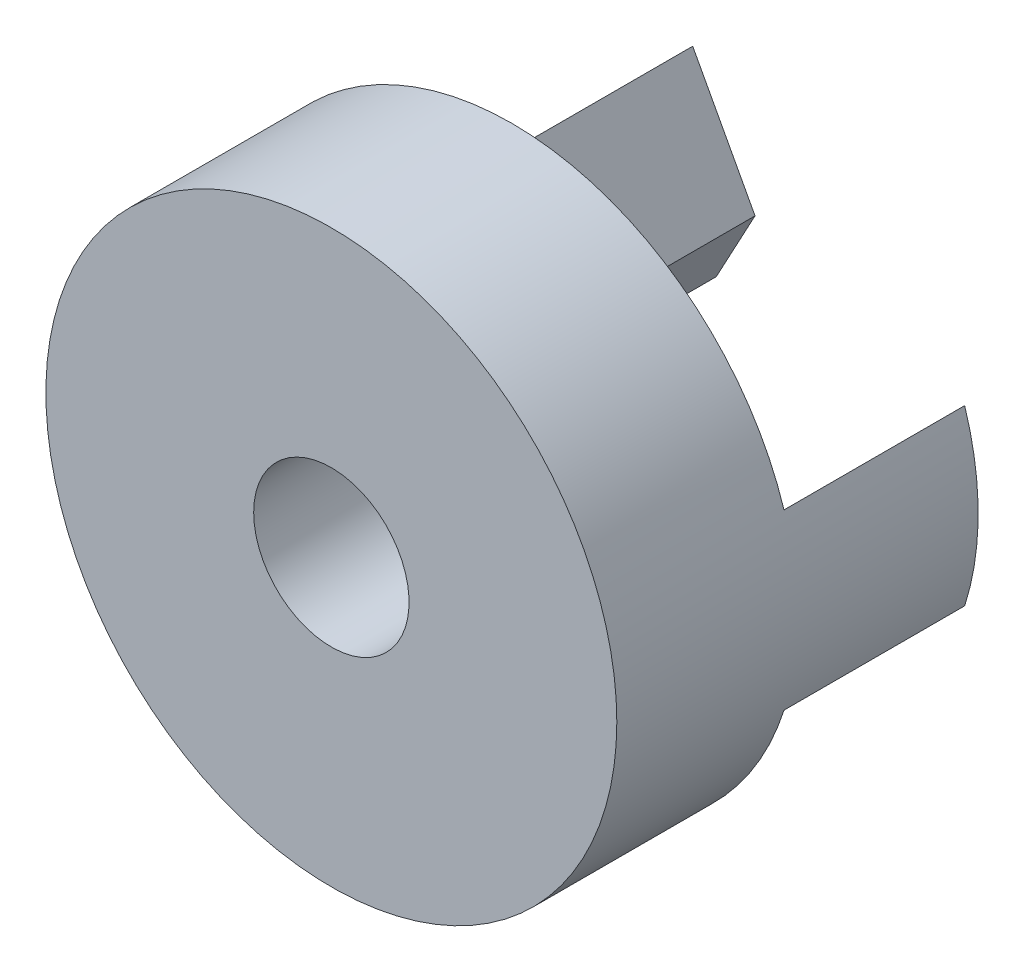
ISO-10303-21;
HEADER;
FILE_DESCRIPTION(('STEP AP214'),'2;1');
FILE_NAME('part.step','',(''),(''),'','','');
FILE_SCHEMA(('AUTOMOTIVE_DESIGN { 1 0 10303 214 1 1 1 1 }'));
ENDSEC;
DATA;
#1=APPLICATION_CONTEXT('core data for automotive mechanical design processes');
#2=APPLICATION_PROTOCOL_DEFINITION('international standard','automotive_design',2000,#1);
#3=PRODUCT_CONTEXT('',#1,'mechanical');
#4=PRODUCT('Part','Part','',(#3));
#5=PRODUCT_RELATED_PRODUCT_CATEGORY('part','',(#4));
#6=PRODUCT_DEFINITION_FORMATION('','',#4);
#7=PRODUCT_DEFINITION_CONTEXT('part definition',#1,'design');
#8=PRODUCT_DEFINITION('design','',#6,#7);
#9=PRODUCT_DEFINITION_SHAPE('','',#8);
#10=(LENGTH_UNIT() NAMED_UNIT(*) SI_UNIT(.MILLI.,.METRE.));
#11=(NAMED_UNIT(*) PLANE_ANGLE_UNIT() SI_UNIT($,.RADIAN.));
#12=(NAMED_UNIT(*) SI_UNIT($,.STERADIAN.) SOLID_ANGLE_UNIT());
#13=UNCERTAINTY_MEASURE_WITH_UNIT(LENGTH_MEASURE(1.E-05),#10,'distance_accuracy_value','');
#14=(GEOMETRIC_REPRESENTATION_CONTEXT(3) GLOBAL_UNCERTAINTY_ASSIGNED_CONTEXT((#13)) GLOBAL_UNIT_ASSIGNED_CONTEXT((#10,
#11,#12)) REPRESENTATION_CONTEXT('',''));
#15=CARTESIAN_POINT('',(0.,0.,0.));
#16=DIRECTION('',(0.,0.,1.));
#17=DIRECTION('',(1.,0.,0.));
#18=AXIS2_PLACEMENT_3D('',#15,#16,#17);
#19=CARTESIAN_POINT('',(0.,0.,0.));
#20=DIRECTION('',(0.,0.,1.));
#21=DIRECTION('',(1.,0.,0.));
#22=AXIS2_PLACEMENT_3D('',#19,#20,#21);
#23=PLANE('',#22);
#24=DIRECTION('',(0.566906215034443,-0.823782339793299,0.));
#25=VECTOR('',#24,1.);
#26=CARTESIAN_POINT('',(-19.1176133447667,6.096,0.));
#27=LINE('',#26,#25);
#28=CARTESIAN_POINT('',(-19.1176133447667,6.096,0.));
#29=VERTEX_POINT('',#28);
#30=CARTESIAN_POINT('',(-14.9225,0.,0.));
#31=VERTEX_POINT('',#30);
#32=EDGE_CURVE('E207',#29,#31,#27,.T.);
#33=ORIENTED_EDGE('',*,*,#32,.F.);
#34=CARTESIAN_POINT('',(0.,0.,0.));
#35=DIRECTION('',(0.,0.,1.));
#36=DIRECTION('',(1.,0.,0.));
#37=AXIS2_PLACEMENT_3D('',#34,#35,#36);
#38=CIRCLE('',#37,20.066);
#39=CARTESIAN_POINT('',(19.1176133447667,6.096,0.));
#40=VERTEX_POINT('',#39);
#41=EDGE_CURVE('E39',#40,#29,#38,.T.);
#42=ORIENTED_EDGE('',*,*,#41,.F.);
#43=DIRECTION('',(0.566906215034443,0.823782339793299,0.));
#44=VECTOR('',#43,1.);
#45=CARTESIAN_POINT('',(14.9225,0.,0.));
#46=LINE('',#45,#44);
#47=CARTESIAN_POINT('',(14.9225,0.,0.));
#48=VERTEX_POINT('',#47);
#49=EDGE_CURVE('E231',#48,#40,#46,.T.);
#50=ORIENTED_EDGE('',*,*,#49,.F.);
#51=DIRECTION('',(-0.566906215034443,0.823782339793299,0.));
#52=VECTOR('',#51,1.);
#53=CARTESIAN_POINT('',(19.1176133447667,-6.096,0.));
#54=LINE('',#53,#52);
#55=CARTESIAN_POINT('',(19.1176133447667,-6.096,0.));
#56=VERTEX_POINT('',#55);
#57=EDGE_CURVE('E226',#56,#48,#54,.T.);
#58=ORIENTED_EDGE('',*,*,#57,.F.);
#59=CARTESIAN_POINT('',(-19.1176133447667,-6.096,0.));
#60=VERTEX_POINT('',#59);
#61=EDGE_CURVE('E252',#60,#56,#38,.T.);
#62=ORIENTED_EDGE('',*,*,#61,.F.);
#63=DIRECTION('',(-0.566906215034443,-0.823782339793299,0.));
#64=VECTOR('',#63,1.);
#65=CARTESIAN_POINT('',(-14.9225,0.,0.));
#66=LINE('',#65,#64);
#67=EDGE_CURVE('E212',#31,#60,#66,.T.);
#68=ORIENTED_EDGE('',*,*,#67,.F.);
#69=EDGE_LOOP('',(#33,#42,#50,#58,#62,#68));
#70=FACE_BOUND('',#69,.T.);
#71=DIRECTION('',(0.474056722401318,-0.880494306594949,0.));
#72=VECTOR('',#71,1.);
#73=CARTESIAN_POINT('',(1.651,-5.20545098910747,0.));
#74=LINE('',#73,#72);
#75=CARTESIAN_POINT('',(1.651,-5.20545098910747,0.));
#76=VERTEX_POINT('',#75);
#77=CARTESIAN_POINT('',(4.3815,-10.2769742700751,0.));
#78=VERTEX_POINT('',#77);
#79=EDGE_CURVE('E278',#76,#78,#74,.T.);
#80=ORIENTED_EDGE('',*,*,#79,.F.);
#81=CARTESIAN_POINT('',(0.,0.,0.));
#82=DIRECTION('',(0.,0.,-1.));
#83=DIRECTION('',(-1.,0.,0.));
#84=AXIS2_PLACEMENT_3D('',#81,#82,#83);
#85=CIRCLE('',#84,5.461);
#86=CARTESIAN_POINT('',(1.651,5.20545098910747,0.));
#87=VERTEX_POINT('',#86);
#88=EDGE_CURVE('E169',#87,#76,#85,.T.);
#89=ORIENTED_EDGE('',*,*,#88,.F.);
#90=DIRECTION('',(-0.474056722401318,-0.880494306594949,0.));
#91=VECTOR('',#90,1.);
#92=CARTESIAN_POINT('',(4.3815,10.2769742700751,0.));
#93=LINE('',#92,#91);
#94=CARTESIAN_POINT('',(4.3815,10.2769742700751,0.));
#95=VERTEX_POINT('',#94);
#96=EDGE_CURVE('E182',#95,#87,#93,.T.);
#97=ORIENTED_EDGE('',*,*,#96,.F.);
#98=DIRECTION('',(0.474056722401318,-0.880494306594949,0.));
#99=VECTOR('',#98,1.);
#100=CARTESIAN_POINT('',(0.,18.415,0.));
#101=LINE('',#100,#99);
#102=CARTESIAN_POINT('',(0.,18.415,0.));
#103=VERTEX_POINT('',#102);
#104=EDGE_CURVE('E191',#103,#95,#101,.T.);
#105=ORIENTED_EDGE('',*,*,#104,.F.);
#106=DIRECTION('',(0.474056722401318,0.880494306594949,0.));
#107=VECTOR('',#106,1.);
#108=CARTESIAN_POINT('',(-4.3815,10.2769742700751,0.));
#109=LINE('',#108,#107);
#110=CARTESIAN_POINT('',(-4.3815,10.2769742700751,0.));
#111=VERTEX_POINT('',#110);
#112=EDGE_CURVE('E172',#111,#103,#109,.T.);
#113=ORIENTED_EDGE('',*,*,#112,.F.);
#114=DIRECTION('',(-0.474056722401318,0.880494306594949,0.));
#115=VECTOR('',#114,1.);
#116=CARTESIAN_POINT('',(-1.651,5.20545098910747,0.));
#117=LINE('',#116,#115);
#118=CARTESIAN_POINT('',(-1.651,5.20545098910747,0.));
#119=VERTEX_POINT('',#118);
#120=EDGE_CURVE('E170',#119,#111,#117,.T.);
#121=ORIENTED_EDGE('',*,*,#120,.F.);
#122=CARTESIAN_POINT('',(-1.651,-5.20545098910747,0.));
#123=VERTEX_POINT('',#122);
#124=EDGE_CURVE('E248',#123,#119,#85,.T.);
#125=ORIENTED_EDGE('',*,*,#124,.F.);
#126=DIRECTION('',(0.474056722401318,0.880494306594949,0.));
#127=VECTOR('',#126,1.);
#128=CARTESIAN_POINT('',(-4.3815,-10.2769742700751,0.));
#129=LINE('',#128,#127);
#130=CARTESIAN_POINT('',(-4.3815,-10.2769742700751,0.));
#131=VERTEX_POINT('',#130);
#132=EDGE_CURVE('E165',#131,#123,#129,.T.);
#133=ORIENTED_EDGE('',*,*,#132,.F.);
#134=DIRECTION('',(-0.474056722401318,0.880494306594949,0.));
#135=VECTOR('',#134,1.);
#136=CARTESIAN_POINT('',(0.,-18.415,0.));
#137=LINE('',#136,#135);
#138=CARTESIAN_POINT('',(0.,-18.415,0.));
#139=VERTEX_POINT('',#138);
#140=EDGE_CURVE('E282',#139,#131,#137,.T.);
#141=ORIENTED_EDGE('',*,*,#140,.F.);
#142=DIRECTION('',(-0.474056722401318,-0.880494306594949,0.));
#143=VECTOR('',#142,1.);
#144=CARTESIAN_POINT('',(4.3815,-10.2769742700751,0.));
#145=LINE('',#144,#143);
#146=EDGE_CURVE('E280',#78,#139,#145,.T.);
#147=ORIENTED_EDGE('',*,*,#146,.F.);
#148=EDGE_LOOP('',(#80,#89,#97,#105,#113,#121,#125,#133,#141,#147));
#149=FACE_BOUND('',#148,.T.);
#150=ADVANCED_FACE('F35',(#70,#149),#23,.F.);
#151=CARTESIAN_POINT('',(0.,0.,12.7));
#152=DIRECTION('',(0.,0.,-1.));
#153=DIRECTION('',(-1.,0.,0.));
#154=AXIS2_PLACEMENT_3D('',#151,#152,#153);
#155=CYLINDRICAL_SURFACE('',#154,20.066);
#156=CARTESIAN_POINT('',(0.,0.,12.7));
#157=DIRECTION('',(0.,0.,1.));
#158=DIRECTION('',(1.,0.,0.));
#159=AXIS2_PLACEMENT_3D('',#156,#157,#158);
#160=CIRCLE('',#159,20.066);
#161=CARTESIAN_POINT('',(20.066,0.,12.7));
#162=VERTEX_POINT('',#161);
#163=EDGE_CURVE('E11',#162,#162,#160,.T.);
#164=ORIENTED_EDGE('',*,*,#163,.F.);
#165=EDGE_LOOP('',(#164));
#166=FACE_BOUND('',#165,.T.);
#167=ORIENTED_EDGE('',*,*,#41,.T.);
#168=DIRECTION('',(0.,0.,1.));
#169=VECTOR('',#168,1.);
#170=CARTESIAN_POINT('',(-19.1176133447667,6.096,-12.7));
#171=LINE('',#170,#169);
#172=CARTESIAN_POINT('',(-19.1176133447667,6.096,-12.7));
#173=VERTEX_POINT('',#172);
#174=EDGE_CURVE('E224',#173,#29,#171,.T.);
#175=ORIENTED_EDGE('',*,*,#174,.F.);
#176=CARTESIAN_POINT('',(0.,0.,-12.7));
#177=DIRECTION('',(0.,0.,-1.));
#178=DIRECTION('',(1.,0.,0.));
#179=AXIS2_PLACEMENT_3D('',#176,#177,#178);
#180=CIRCLE('',#179,20.066);
#181=CARTESIAN_POINT('',(-19.1176133447667,-6.096,-12.7));
#182=VERTEX_POINT('',#181);
#183=EDGE_CURVE('E208',#182,#173,#180,.T.);
#184=ORIENTED_EDGE('',*,*,#183,.F.);
#185=DIRECTION('',(0.,0.,1.));
#186=VECTOR('',#185,1.);
#187=CARTESIAN_POINT('',(-19.1176133447667,-6.096,-12.7));
#188=LINE('',#187,#186);
#189=EDGE_CURVE('E216',#182,#60,#188,.T.);
#190=ORIENTED_EDGE('',*,*,#189,.T.);
#191=ORIENTED_EDGE('',*,*,#61,.T.);
#192=DIRECTION('',(0.,0.,1.));
#193=VECTOR('',#192,1.);
#194=CARTESIAN_POINT('',(19.1176133447667,-6.096,-12.7));
#195=LINE('',#194,#193);
#196=CARTESIAN_POINT('',(19.1176133447667,-6.096,-12.7));
#197=VERTEX_POINT('',#196);
#198=EDGE_CURVE('E245',#197,#56,#195,.T.);
#199=ORIENTED_EDGE('',*,*,#198,.F.);
#200=CARTESIAN_POINT('',(0.,0.,-12.7));
#201=DIRECTION('',(0.,0.,-1.));
#202=DIRECTION('',(-1.,0.,0.));
#203=AXIS2_PLACEMENT_3D('',#200,#201,#202);
#204=CIRCLE('',#203,20.066);
#205=CARTESIAN_POINT('',(19.1176133447667,6.096,-12.7));
#206=VERTEX_POINT('',#205);
#207=EDGE_CURVE('E227',#206,#197,#204,.T.);
#208=ORIENTED_EDGE('',*,*,#207,.F.);
#209=DIRECTION('',(0.,0.,1.));
#210=VECTOR('',#209,1.);
#211=CARTESIAN_POINT('',(19.1176133447667,6.096,-12.7));
#212=LINE('',#211,#210);
#213=EDGE_CURVE('E235',#206,#40,#212,.T.);
#214=ORIENTED_EDGE('',*,*,#213,.T.);
#215=EDGE_LOOP('',(#167,#175,#184,#190,#191,#199,#208,#214));
#216=FACE_BOUND('',#215,.T.);
#217=ADVANCED_FACE('F37',(#166,#216),#155,.T.);
#218=CARTESIAN_POINT('',(0.,0.,12.7));
#219=DIRECTION('',(0.,0.,1.));
#220=DIRECTION('',(1.,0.,0.));
#221=AXIS2_PLACEMENT_3D('',#218,#219,#220);
#222=PLANE('',#221);
#223=CARTESIAN_POINT('',(0.,0.,12.7));
#224=DIRECTION('',(0.,0.,-1.));
#225=DIRECTION('',(-1.,0.,0.));
#226=AXIS2_PLACEMENT_3D('',#223,#224,#225);
#227=CIRCLE('',#226,5.461);
#228=CARTESIAN_POINT('',(-5.461,0.,12.7));
#229=VERTEX_POINT('',#228);
#230=EDGE_CURVE('E249',#229,#229,#227,.T.);
#231=ORIENTED_EDGE('',*,*,#230,.T.);
#232=EDGE_LOOP('',(#231));
#233=FACE_BOUND('',#232,.T.);
#234=ORIENTED_EDGE('',*,*,#163,.T.);
#235=EDGE_LOOP('',(#234));
#236=FACE_BOUND('',#235,.T.);
#237=ADVANCED_FACE('F317',(#233,#236),#222,.T.);
#238=CARTESIAN_POINT('',(0.,0.,12.7));
#239=DIRECTION('',(0.,0.,-1.));
#240=DIRECTION('',(-1.,0.,0.));
#241=AXIS2_PLACEMENT_3D('',#238,#239,#240);
#242=CYLINDRICAL_SURFACE('',#241,5.461);
#243=ORIENTED_EDGE('',*,*,#230,.F.);
#244=EDGE_LOOP('',(#243));
#245=FACE_BOUND('',#244,.T.);
#246=ORIENTED_EDGE('',*,*,#88,.T.);
#247=DIRECTION('',(0.,0.,1.));
#248=VECTOR('',#247,1.);
#249=CARTESIAN_POINT('',(1.651,-5.20545098910747,-12.7));
#250=LINE('',#249,#248);
#251=CARTESIAN_POINT('',(1.651,-5.20545098910747,-12.7));
#252=VERTEX_POINT('',#251);
#253=EDGE_CURVE('E153',#252,#76,#250,.T.);
#254=ORIENTED_EDGE('',*,*,#253,.F.);
#255=CARTESIAN_POINT('',(0.,0.,-12.7));
#256=DIRECTION('',(0.,0.,1.));
#257=DIRECTION('',(-1.,0.,0.));
#258=AXIS2_PLACEMENT_3D('',#255,#256,#257);
#259=CIRCLE('',#258,5.461);
#260=CARTESIAN_POINT('',(-1.651,-5.20545098910747,-12.7));
#261=VERTEX_POINT('',#260);
#262=EDGE_CURVE('E160',#261,#252,#259,.T.);
#263=ORIENTED_EDGE('',*,*,#262,.F.);
#264=DIRECTION('',(0.,0.,1.));
#265=VECTOR('',#264,1.);
#266=CARTESIAN_POINT('',(-1.651,-5.20545098910747,-12.7));
#267=LINE('',#266,#265);
#268=EDGE_CURVE('E50',#261,#123,#267,.T.);
#269=ORIENTED_EDGE('',*,*,#268,.T.);
#270=ORIENTED_EDGE('',*,*,#124,.T.);
#271=DIRECTION('',(0.,0.,1.));
#272=VECTOR('',#271,1.);
#273=CARTESIAN_POINT('',(-1.651,5.20545098910747,-12.7));
#274=LINE('',#273,#272);
#275=CARTESIAN_POINT('',(-1.651,5.20545098910747,-12.7));
#276=VERTEX_POINT('',#275);
#277=EDGE_CURVE('E204',#276,#119,#274,.T.);
#278=ORIENTED_EDGE('',*,*,#277,.F.);
#279=CARTESIAN_POINT('',(0.,0.,-12.7));
#280=DIRECTION('',(0.,0.,1.));
#281=DIRECTION('',(1.,0.,0.));
#282=AXIS2_PLACEMENT_3D('',#279,#280,#281);
#283=CIRCLE('',#282,5.461);
#284=CARTESIAN_POINT('',(1.651,5.20545098910747,-12.7));
#285=VERTEX_POINT('',#284);
#286=EDGE_CURVE('E178',#285,#276,#283,.T.);
#287=ORIENTED_EDGE('',*,*,#286,.F.);
#288=DIRECTION('',(0.,0.,1.));
#289=VECTOR('',#288,1.);
#290=CARTESIAN_POINT('',(1.651,5.20545098910747,-12.7));
#291=LINE('',#290,#289);
#292=EDGE_CURVE('E57',#285,#87,#291,.T.);
#293=ORIENTED_EDGE('',*,*,#292,.T.);
#294=EDGE_LOOP('',(#246,#254,#263,#269,#270,#278,#287,#293));
#295=FACE_BOUND('',#294,.T.);
#296=ADVANCED_FACE('F167',(#245,#295),#242,.F.);
#297=CARTESIAN_POINT('',(19.1176133447667,-6.096,-12.7));
#298=DIRECTION('',(0.823782339793299,0.566906215034443,0.));
#299=DIRECTION('',(-0.566906215034443,0.823782339793299,0.));
#300=AXIS2_PLACEMENT_3D('',#297,#298,#299);
#301=PLANE('',#300);
#302=ORIENTED_EDGE('',*,*,#57,.T.);
#303=DIRECTION('',(0.,0.,1.));
#304=VECTOR('',#303,1.);
#305=CARTESIAN_POINT('',(14.9225,0.,-12.7));
#306=LINE('',#305,#304);
#307=CARTESIAN_POINT('',(14.9225,0.,-12.7));
#308=VERTEX_POINT('',#307);
#309=EDGE_CURVE('E242',#308,#48,#306,.T.);
#310=ORIENTED_EDGE('',*,*,#309,.F.);
#311=DIRECTION('',(-0.566906215034443,0.823782339793299,0.));
#312=VECTOR('',#311,1.);
#313=CARTESIAN_POINT('',(19.1176133447667,-6.096,-12.7));
#314=LINE('',#313,#312);
#315=EDGE_CURVE('E230',#197,#308,#314,.T.);
#316=ORIENTED_EDGE('',*,*,#315,.F.);
#317=ORIENTED_EDGE('',*,*,#198,.T.);
#318=EDGE_LOOP('',(#302,#310,#316,#317));
#319=FACE_BOUND('',#318,.T.);
#320=ADVANCED_FACE('F326',(#319),#301,.F.);
#321=CARTESIAN_POINT('',(14.9225,0.,-12.7));
#322=DIRECTION('',(0.823782339793299,-0.566906215034443,0.));
#323=DIRECTION('',(0.566906215034443,0.823782339793299,0.));
#324=AXIS2_PLACEMENT_3D('',#321,#322,#323);
#325=PLANE('',#324);
#326=ORIENTED_EDGE('',*,*,#49,.T.);
#327=ORIENTED_EDGE('',*,*,#213,.F.);
#328=DIRECTION('',(0.566906215034443,0.823782339793299,0.));
#329=VECTOR('',#328,1.);
#330=CARTESIAN_POINT('',(14.9225,0.,-12.7));
#331=LINE('',#330,#329);
#332=EDGE_CURVE('E233',#308,#206,#331,.T.);
#333=ORIENTED_EDGE('',*,*,#332,.F.);
#334=ORIENTED_EDGE('',*,*,#309,.T.);
#335=EDGE_LOOP('',(#326,#327,#333,#334));
#336=FACE_BOUND('',#335,.T.);
#337=ADVANCED_FACE('F330',(#336),#325,.F.);
#338=CARTESIAN_POINT('',(0.,0.,-12.7));
#339=DIRECTION('',(0.,0.,-1.));
#340=DIRECTION('',(-1.,0.,0.));
#341=AXIS2_PLACEMENT_3D('',#338,#339,#340);
#342=PLANE('',#341);
#343=ORIENTED_EDGE('',*,*,#207,.T.);
#344=ORIENTED_EDGE('',*,*,#315,.T.);
#345=ORIENTED_EDGE('',*,*,#332,.T.);
#346=EDGE_LOOP('',(#343,#344,#345));
#347=FACE_BOUND('',#346,.T.);
#348=ADVANCED_FACE('F334',(#347),#342,.T.);
#349=CARTESIAN_POINT('',(-19.1176133447667,6.096,-12.7));
#350=DIRECTION('',(-0.823782339793299,-0.566906215034443,0.));
#351=DIRECTION('',(0.566906215034443,-0.823782339793299,0.));
#352=AXIS2_PLACEMENT_3D('',#349,#350,#351);
#353=PLANE('',#352);
#354=ORIENTED_EDGE('',*,*,#32,.T.);
#355=DIRECTION('',(0.,0.,1.));
#356=VECTOR('',#355,1.);
#357=CARTESIAN_POINT('',(-14.9225,0.,-12.7));
#358=LINE('',#357,#356);
#359=CARTESIAN_POINT('',(-14.9225,0.,-12.7));
#360=VERTEX_POINT('',#359);
#361=EDGE_CURVE('E221',#360,#31,#358,.T.);
#362=ORIENTED_EDGE('',*,*,#361,.F.);
#363=DIRECTION('',(0.566906215034443,-0.823782339793299,0.));
#364=VECTOR('',#363,1.);
#365=CARTESIAN_POINT('',(-19.1176133447667,6.096,-12.7));
#366=LINE('',#365,#364);
#367=EDGE_CURVE('E211',#173,#360,#366,.T.);
#368=ORIENTED_EDGE('',*,*,#367,.F.);
#369=ORIENTED_EDGE('',*,*,#174,.T.);
#370=EDGE_LOOP('',(#354,#362,#368,#369));
#371=FACE_BOUND('',#370,.T.);
#372=ADVANCED_FACE('F338',(#371),#353,.F.);
#373=CARTESIAN_POINT('',(-14.9225,0.,-12.7));
#374=DIRECTION('',(-0.823782339793299,0.566906215034443,0.));
#375=DIRECTION('',(-0.566906215034443,-0.823782339793299,0.));
#376=AXIS2_PLACEMENT_3D('',#373,#374,#375);
#377=PLANE('',#376);
#378=ORIENTED_EDGE('',*,*,#67,.T.);
#379=ORIENTED_EDGE('',*,*,#189,.F.);
#380=DIRECTION('',(-0.566906215034443,-0.823782339793299,0.));
#381=VECTOR('',#380,1.);
#382=CARTESIAN_POINT('',(-14.9225,0.,-12.7));
#383=LINE('',#382,#381);
#384=EDGE_CURVE('E214',#360,#182,#383,.T.);
#385=ORIENTED_EDGE('',*,*,#384,.F.);
#386=ORIENTED_EDGE('',*,*,#361,.T.);
#387=EDGE_LOOP('',(#378,#379,#385,#386));
#388=FACE_BOUND('',#387,.T.);
#389=ADVANCED_FACE('F342',(#388),#377,.F.);
#390=CARTESIAN_POINT('',(0.,0.,-12.7));
#391=DIRECTION('',(0.,0.,1.));
#392=DIRECTION('',(1.,0.,0.));
#393=AXIS2_PLACEMENT_3D('',#390,#391,#392);
#394=PLANE('',#393);
#395=ORIENTED_EDGE('',*,*,#183,.T.);
#396=ORIENTED_EDGE('',*,*,#367,.T.);
#397=ORIENTED_EDGE('',*,*,#384,.T.);
#398=EDGE_LOOP('',(#395,#396,#397));
#399=FACE_BOUND('',#398,.T.);
#400=ADVANCED_FACE('F346',(#399),#394,.F.);
#401=CARTESIAN_POINT('',(-1.651,5.20545098910747,-12.7));
#402=DIRECTION('',(0.880494306594949,0.474056722401318,0.));
#403=DIRECTION('',(-0.474056722401318,0.880494306594949,0.));
#404=AXIS2_PLACEMENT_3D('',#401,#402,#403);
#405=PLANE('',#404);
#406=ORIENTED_EDGE('',*,*,#120,.T.);
#407=DIRECTION('',(0.,0.,1.));
#408=VECTOR('',#407,1.);
#409=CARTESIAN_POINT('',(-4.3815,10.2769742700751,-12.7));
#410=LINE('',#409,#408);
#411=CARTESIAN_POINT('',(-4.3815,10.2769742700751,-12.7));
#412=VERTEX_POINT('',#411);
#413=EDGE_CURVE('E201',#412,#111,#410,.T.);
#414=ORIENTED_EDGE('',*,*,#413,.F.);
#415=DIRECTION('',(-0.474056722401318,0.880494306594949,0.));
#416=VECTOR('',#415,1.);
#417=CARTESIAN_POINT('',(-1.651,5.20545098910747,-12.7));
#418=LINE('',#417,#416);
#419=EDGE_CURVE('E181',#276,#412,#418,.T.);
#420=ORIENTED_EDGE('',*,*,#419,.F.);
#421=ORIENTED_EDGE('',*,*,#277,.T.);
#422=EDGE_LOOP('',(#406,#414,#420,#421));
#423=FACE_BOUND('',#422,.T.);
#424=ADVANCED_FACE('F259',(#423),#405,.F.);
#425=CARTESIAN_POINT('',(-4.3815,10.2769742700751,-12.7));
#426=DIRECTION('',(0.880494306594949,-0.474056722401318,0.));
#427=DIRECTION('',(0.474056722401318,0.880494306594949,0.));
#428=AXIS2_PLACEMENT_3D('',#425,#426,#427);
#429=PLANE('',#428);
#430=ORIENTED_EDGE('',*,*,#112,.T.);
#431=DIRECTION('',(0.,0.,1.));
#432=VECTOR('',#431,1.);
#433=CARTESIAN_POINT('',(0.,18.415,-12.7));
#434=LINE('',#433,#432);
#435=CARTESIAN_POINT('',(0.,18.415,-12.7));
#436=VERTEX_POINT('',#435);
#437=EDGE_CURVE('E198',#436,#103,#434,.T.);
#438=ORIENTED_EDGE('',*,*,#437,.F.);
#439=DIRECTION('',(0.474056722401318,0.880494306594949,0.));
#440=VECTOR('',#439,1.);
#441=CARTESIAN_POINT('',(-4.3815,10.2769742700751,-12.7));
#442=LINE('',#441,#440);
#443=EDGE_CURVE('E184',#412,#436,#442,.T.);
#444=ORIENTED_EDGE('',*,*,#443,.F.);
#445=ORIENTED_EDGE('',*,*,#413,.T.);
#446=EDGE_LOOP('',(#430,#438,#444,#445));
#447=FACE_BOUND('',#446,.T.);
#448=ADVANCED_FACE('F266',(#447),#429,.F.);
#449=CARTESIAN_POINT('',(0.,18.415,-12.7));
#450=DIRECTION('',(-0.880494306594949,-0.474056722401318,0.));
#451=DIRECTION('',(0.474056722401318,-0.880494306594949,0.));
#452=AXIS2_PLACEMENT_3D('',#449,#450,#451);
#453=PLANE('',#452);
#454=ORIENTED_EDGE('',*,*,#104,.T.);
#455=DIRECTION('',(0.,0.,1.));
#456=VECTOR('',#455,1.);
#457=CARTESIAN_POINT('',(4.3815,10.2769742700751,-12.7));
#458=LINE('',#457,#456);
#459=CARTESIAN_POINT('',(4.3815,10.2769742700751,-12.7));
#460=VERTEX_POINT('',#459);
#461=EDGE_CURVE('E195',#460,#95,#458,.T.);
#462=ORIENTED_EDGE('',*,*,#461,.F.);
#463=DIRECTION('',(0.474056722401318,-0.880494306594949,0.));
#464=VECTOR('',#463,1.);
#465=CARTESIAN_POINT('',(0.,18.415,-12.7));
#466=LINE('',#465,#464);
#467=EDGE_CURVE('E186',#436,#460,#466,.T.);
#468=ORIENTED_EDGE('',*,*,#467,.F.);
#469=ORIENTED_EDGE('',*,*,#437,.T.);
#470=EDGE_LOOP('',(#454,#462,#468,#469));
#471=FACE_BOUND('',#470,.T.);
#472=ADVANCED_FACE('F270',(#471),#453,.F.);
#473=CARTESIAN_POINT('',(4.3815,10.2769742700751,-12.7));
#474=DIRECTION('',(-0.880494306594949,0.474056722401318,0.));
#475=DIRECTION('',(-0.474056722401318,-0.880494306594949,0.));
#476=AXIS2_PLACEMENT_3D('',#473,#474,#475);
#477=PLANE('',#476);
#478=ORIENTED_EDGE('',*,*,#96,.T.);
#479=ORIENTED_EDGE('',*,*,#292,.F.);
#480=DIRECTION('',(-0.474056722401318,-0.880494306594949,0.));
#481=VECTOR('',#480,1.);
#482=CARTESIAN_POINT('',(4.3815,10.2769742700751,-12.7));
#483=LINE('',#482,#481);
#484=EDGE_CURVE('E188',#460,#285,#483,.T.);
#485=ORIENTED_EDGE('',*,*,#484,.F.);
#486=ORIENTED_EDGE('',*,*,#461,.T.);
#487=EDGE_LOOP('',(#478,#479,#485,#486));
#488=FACE_BOUND('',#487,.T.);
#489=ADVANCED_FACE('F276',(#488),#477,.F.);
#490=CARTESIAN_POINT('',(0.,0.,-12.7));
#491=DIRECTION('',(0.,0.,1.));
#492=DIRECTION('',(1.,0.,0.));
#493=AXIS2_PLACEMENT_3D('',#490,#491,#492);
#494=PLANE('',#493);
#495=ORIENTED_EDGE('',*,*,#286,.T.);
#496=ORIENTED_EDGE('',*,*,#419,.T.);
#497=ORIENTED_EDGE('',*,*,#443,.T.);
#498=ORIENTED_EDGE('',*,*,#467,.T.);
#499=ORIENTED_EDGE('',*,*,#484,.T.);
#500=EDGE_LOOP('',(#495,#496,#497,#498,#499));
#501=FACE_BOUND('',#500,.T.);
#502=ADVANCED_FACE('F274',(#501),#494,.F.);
#503=CARTESIAN_POINT('',(1.651,-5.20545098910747,-12.7));
#504=DIRECTION('',(-0.880494306594949,-0.474056722401318,0.));
#505=DIRECTION('',(0.474056722401318,-0.880494306594949,0.));
#506=AXIS2_PLACEMENT_3D('',#503,#504,#505);
#507=PLANE('',#506);
#508=ORIENTED_EDGE('',*,*,#79,.T.);
#509=DIRECTION('',(0.,0.,1.));
#510=VECTOR('',#509,1.);
#511=CARTESIAN_POINT('',(4.3815,-10.2769742700751,-12.7));
#512=LINE('',#511,#510);
#513=CARTESIAN_POINT('',(4.3815,-10.2769742700751,-12.7));
#514=VERTEX_POINT('',#513);
#515=EDGE_CURVE('E156',#514,#78,#512,.T.);
#516=ORIENTED_EDGE('',*,*,#515,.F.);
#517=DIRECTION('',(0.474056722401318,-0.880494306594949,0.));
#518=VECTOR('',#517,1.);
#519=CARTESIAN_POINT('',(1.651,-5.20545098910747,-12.7));
#520=LINE('',#519,#518);
#521=EDGE_CURVE('E149',#252,#514,#520,.T.);
#522=ORIENTED_EDGE('',*,*,#521,.F.);
#523=ORIENTED_EDGE('',*,*,#253,.T.);
#524=EDGE_LOOP('',(#508,#516,#522,#523));
#525=FACE_BOUND('',#524,.T.);
#526=ADVANCED_FACE('F151',(#525),#507,.F.);
#527=CARTESIAN_POINT('',(4.3815,-10.2769742700751,-12.7));
#528=DIRECTION('',(-0.880494306594949,0.474056722401318,0.));
#529=DIRECTION('',(-0.474056722401318,-0.880494306594949,0.));
#530=AXIS2_PLACEMENT_3D('',#527,#528,#529);
#531=PLANE('',#530);
#532=ORIENTED_EDGE('',*,*,#146,.T.);
#533=DIRECTION('',(0.,0.,1.));
#534=VECTOR('',#533,1.);
#535=CARTESIAN_POINT('',(0.,-18.415,-12.7));
#536=LINE('',#535,#534);
#537=CARTESIAN_POINT('',(0.,-18.415,-12.7));
#538=VERTEX_POINT('',#537);
#539=EDGE_CURVE('E174',#538,#139,#536,.T.);
#540=ORIENTED_EDGE('',*,*,#539,.F.);
#541=DIRECTION('',(-0.474056722401318,-0.880494306594949,0.));
#542=VECTOR('',#541,1.);
#543=CARTESIAN_POINT('',(4.3815,-10.2769742700751,-12.7));
#544=LINE('',#543,#542);
#545=EDGE_CURVE('E159',#514,#538,#544,.T.);
#546=ORIENTED_EDGE('',*,*,#545,.F.);
#547=ORIENTED_EDGE('',*,*,#515,.T.);
#548=EDGE_LOOP('',(#532,#540,#546,#547));
#549=FACE_BOUND('',#548,.T.);
#550=ADVANCED_FACE('F303',(#549),#531,.F.);
#551=CARTESIAN_POINT('',(0.,-18.415,-12.7));
#552=DIRECTION('',(0.880494306594949,0.474056722401318,0.));
#553=DIRECTION('',(-0.474056722401318,0.880494306594949,0.));
#554=AXIS2_PLACEMENT_3D('',#551,#552,#553);
#555=PLANE('',#554);
#556=ORIENTED_EDGE('',*,*,#140,.T.);
#557=DIRECTION('',(0.,0.,1.));
#558=VECTOR('',#557,1.);
#559=CARTESIAN_POINT('',(-4.3815,-10.2769742700751,-12.7));
#560=LINE('',#559,#558);
#561=CARTESIAN_POINT('',(-4.3815,-10.2769742700751,-12.7));
#562=VERTEX_POINT('',#561);
#563=EDGE_CURVE('E290',#562,#131,#560,.T.);
#564=ORIENTED_EDGE('',*,*,#563,.F.);
#565=DIRECTION('',(-0.474056722401318,0.880494306594949,0.));
#566=VECTOR('',#565,1.);
#567=CARTESIAN_POINT('',(0.,-18.415,-12.7));
#568=LINE('',#567,#566);
#569=EDGE_CURVE('E298',#538,#562,#568,.T.);
#570=ORIENTED_EDGE('',*,*,#569,.F.);
#571=ORIENTED_EDGE('',*,*,#539,.T.);
#572=EDGE_LOOP('',(#556,#564,#570,#571));
#573=FACE_BOUND('',#572,.T.);
#574=ADVANCED_FACE('F296',(#573),#555,.F.);
#575=CARTESIAN_POINT('',(-4.3815,-10.2769742700751,-12.7));
#576=DIRECTION('',(0.880494306594949,-0.474056722401318,0.));
#577=DIRECTION('',(0.474056722401318,0.880494306594949,0.));
#578=AXIS2_PLACEMENT_3D('',#575,#576,#577);
#579=PLANE('',#578);
#580=ORIENTED_EDGE('',*,*,#132,.T.);
#581=ORIENTED_EDGE('',*,*,#268,.F.);
#582=DIRECTION('',(0.474056722401318,0.880494306594949,0.));
#583=VECTOR('',#582,1.);
#584=CARTESIAN_POINT('',(-4.3815,-10.2769742700751,-12.7));
#585=LINE('',#584,#583);
#586=EDGE_CURVE('E164',#562,#261,#585,.T.);
#587=ORIENTED_EDGE('',*,*,#586,.F.);
#588=ORIENTED_EDGE('',*,*,#563,.T.);
#589=EDGE_LOOP('',(#580,#581,#587,#588));
#590=FACE_BOUND('',#589,.T.);
#591=ADVANCED_FACE('F301',(#590),#579,.F.);
#592=CARTESIAN_POINT('',(0.,0.,-12.7));
#593=DIRECTION('',(0.,0.,-1.));
#594=DIRECTION('',(-1.,0.,0.));
#595=AXIS2_PLACEMENT_3D('',#592,#593,#594);
#596=PLANE('',#595);
#597=ORIENTED_EDGE('',*,*,#262,.T.);
#598=ORIENTED_EDGE('',*,*,#521,.T.);
#599=ORIENTED_EDGE('',*,*,#545,.T.);
#600=ORIENTED_EDGE('',*,*,#569,.T.);
#601=ORIENTED_EDGE('',*,*,#586,.T.);
#602=EDGE_LOOP('',(#597,#598,#599,#600,#601));
#603=FACE_BOUND('',#602,.T.);
#604=ADVANCED_FACE('F162',(#603),#596,.T.);
#605=CLOSED_SHELL('',(#150,#217,#237,#296,#320,#337,#348,#372,#389,#400,#424,#448,#472,#489,
#502,#526,#550,#574,#591,#604));
#606=MANIFOLD_SOLID_BREP('B2',#605);
#607=ADVANCED_BREP_SHAPE_REPRESENTATION('',(#18,#606),#14);
#608=SHAPE_DEFINITION_REPRESENTATION(#9,#607);
ENDSEC;
END-ISO-10303-21;
